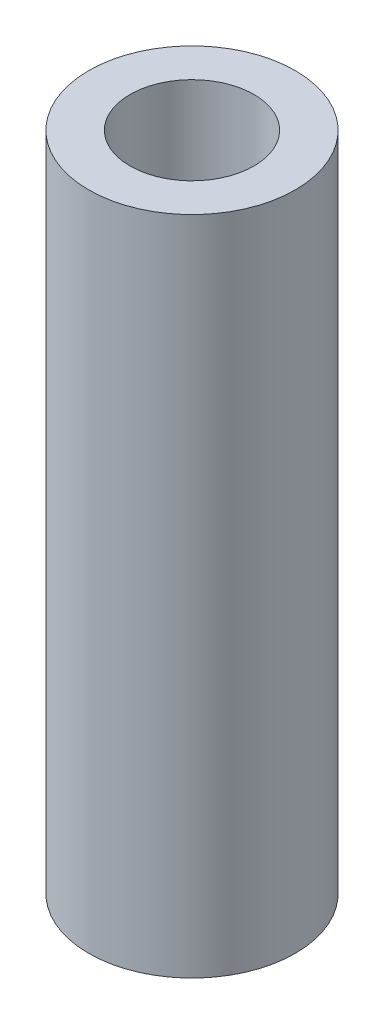
ISO-10303-21;
HEADER;
FILE_DESCRIPTION(('STEP AP214'),'2;1');
FILE_NAME('part.step','',(''),(''),'','','');
FILE_SCHEMA(('AUTOMOTIVE_DESIGN { 1 0 10303 214 1 1 1 1 }'));
ENDSEC;
DATA;
#1=APPLICATION_CONTEXT('core data for automotive mechanical design processes');
#2=APPLICATION_PROTOCOL_DEFINITION('international standard','automotive_design',2000,#1);
#3=PRODUCT_CONTEXT('',#1,'mechanical');
#4=PRODUCT('Part','Part','',(#3));
#5=PRODUCT_RELATED_PRODUCT_CATEGORY('part','',(#4));
#6=PRODUCT_DEFINITION_FORMATION('','',#4);
#7=PRODUCT_DEFINITION_CONTEXT('part definition',#1,'design');
#8=PRODUCT_DEFINITION('design','',#6,#7);
#9=PRODUCT_DEFINITION_SHAPE('','',#8);
#10=(LENGTH_UNIT() NAMED_UNIT(*) SI_UNIT(.MILLI.,.METRE.));
#11=(NAMED_UNIT(*) PLANE_ANGLE_UNIT() SI_UNIT($,.RADIAN.));
#12=(NAMED_UNIT(*) SI_UNIT($,.STERADIAN.) SOLID_ANGLE_UNIT());
#13=UNCERTAINTY_MEASURE_WITH_UNIT(LENGTH_MEASURE(1.E-05),#10,'distance_accuracy_value','');
#14=(GEOMETRIC_REPRESENTATION_CONTEXT(3) GLOBAL_UNCERTAINTY_ASSIGNED_CONTEXT((#13)) GLOBAL_UNIT_ASSIGNED_CONTEXT((#10,
#11,#12)) REPRESENTATION_CONTEXT('',''));
#15=CARTESIAN_POINT('',(0.,0.,0.));
#16=DIRECTION('',(0.,0.,1.));
#17=DIRECTION('',(1.,0.,0.));
#18=AXIS2_PLACEMENT_3D('',#15,#16,#17);
#19=CARTESIAN_POINT('',(0.,16.,0.));
#20=DIRECTION('',(0.,1.,0.));
#21=DIRECTION('',(0.,0.,1.));
#22=AXIS2_PLACEMENT_3D('',#19,#20,#21);
#23=PLANE('',#22);
#24=CARTESIAN_POINT('',(0.,16.,0.));
#25=DIRECTION('',(0.,1.,0.));
#26=DIRECTION('',(0.,0.,1.));
#27=AXIS2_PLACEMENT_3D('',#24,#25,#26);
#28=CIRCLE('',#27,2.5);
#29=CARTESIAN_POINT('',(0.,16.,2.5));
#30=VERTEX_POINT('',#29);
#31=EDGE_CURVE('E10',#30,#30,#28,.T.);
#32=ORIENTED_EDGE('',*,*,#31,.T.);
#33=EDGE_LOOP('',(#32));
#34=FACE_BOUND('',#33,.T.);
#35=CARTESIAN_POINT('',(0.,16.,0.));
#36=DIRECTION('',(0.,1.,0.));
#37=DIRECTION('',(0.,0.,1.));
#38=AXIS2_PLACEMENT_3D('',#35,#36,#37);
#39=CIRCLE('',#38,1.5);
#40=CARTESIAN_POINT('',(0.,16.,1.5));
#41=VERTEX_POINT('',#40);
#42=EDGE_CURVE('E53',#41,#41,#39,.T.);
#43=ORIENTED_EDGE('',*,*,#42,.F.);
#44=EDGE_LOOP('',(#43));
#45=FACE_BOUND('',#44,.T.);
#46=ADVANCED_FACE('F40',(#34,#45),#23,.T.);
#47=CARTESIAN_POINT('',(0.,0.,0.));
#48=DIRECTION('',(0.,1.,0.));
#49=DIRECTION('',(0.,0.,1.));
#50=AXIS2_PLACEMENT_3D('',#47,#48,#49);
#51=PLANE('',#50);
#52=CARTESIAN_POINT('',(0.,0.,0.));
#53=DIRECTION('',(0.,1.,0.));
#54=DIRECTION('',(0.,0.,1.));
#55=AXIS2_PLACEMENT_3D('',#52,#53,#54);
#56=CIRCLE('',#55,2.5);
#57=CARTESIAN_POINT('',(0.,0.,2.5));
#58=VERTEX_POINT('',#57);
#59=EDGE_CURVE('E44',#58,#58,#56,.T.);
#60=ORIENTED_EDGE('',*,*,#59,.F.);
#61=EDGE_LOOP('',(#60));
#62=FACE_BOUND('',#61,.T.);
#63=CARTESIAN_POINT('',(0.,0.,0.));
#64=DIRECTION('',(0.,1.,0.));
#65=DIRECTION('',(0.,0.,1.));
#66=AXIS2_PLACEMENT_3D('',#63,#64,#65);
#67=CIRCLE('',#66,1.5);
#68=CARTESIAN_POINT('',(0.,0.,1.5));
#69=VERTEX_POINT('',#68);
#70=EDGE_CURVE('E55',#69,#69,#67,.T.);
#71=ORIENTED_EDGE('',*,*,#70,.T.);
#72=EDGE_LOOP('',(#71));
#73=FACE_BOUND('',#72,.T.);
#74=ADVANCED_FACE('F67',(#62,#73),#51,.F.);
#75=CARTESIAN_POINT('',(0.,16.,0.));
#76=DIRECTION('',(0.,-1.,0.));
#77=DIRECTION('',(0.,0.,-1.));
#78=AXIS2_PLACEMENT_3D('',#75,#76,#77);
#79=CYLINDRICAL_SURFACE('',#78,2.5);
#80=ORIENTED_EDGE('',*,*,#31,.F.);
#81=EDGE_LOOP('',(#80));
#82=FACE_BOUND('',#81,.T.);
#83=ORIENTED_EDGE('',*,*,#59,.T.);
#84=EDGE_LOOP('',(#83));
#85=FACE_BOUND('',#84,.T.);
#86=ADVANCED_FACE('F42',(#82,#85),#79,.T.);
#87=CARTESIAN_POINT('',(0.,16.,0.));
#88=DIRECTION('',(0.,-1.,0.));
#89=DIRECTION('',(0.,0.,-1.));
#90=AXIS2_PLACEMENT_3D('',#87,#88,#89);
#91=CYLINDRICAL_SURFACE('',#90,1.5);
#92=ORIENTED_EDGE('',*,*,#42,.T.);
#93=EDGE_LOOP('',(#92));
#94=FACE_BOUND('',#93,.T.);
#95=ORIENTED_EDGE('',*,*,#70,.F.);
#96=EDGE_LOOP('',(#95));
#97=FACE_BOUND('',#96,.T.);
#98=ADVANCED_FACE('F63',(#94,#97),#91,.F.);
#99=CLOSED_SHELL('',(#46,#74,#86,#98));
#100=MANIFOLD_SOLID_BREP('B2',#99);
#101=ADVANCED_BREP_SHAPE_REPRESENTATION('',(#18,#100),#14);
#102=SHAPE_DEFINITION_REPRESENTATION(#9,#101);
ENDSEC;
END-ISO-10303-21;
